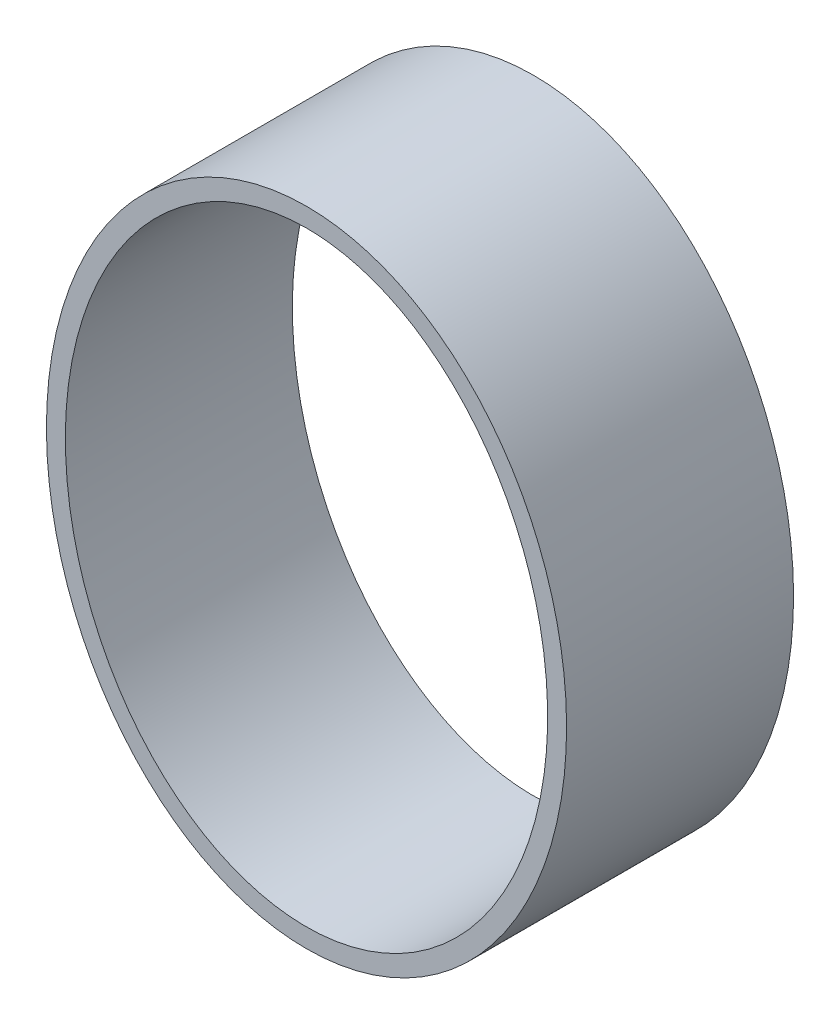
ISO-10303-21;
HEADER;
FILE_DESCRIPTION(('STEP AP214'),'2;1');
FILE_NAME('part.step','',(''),(''),'','','');
FILE_SCHEMA(('AUTOMOTIVE_DESIGN { 1 0 10303 214 1 1 1 1 }'));
ENDSEC;
DATA;
#1=APPLICATION_CONTEXT('core data for automotive mechanical design processes');
#2=APPLICATION_PROTOCOL_DEFINITION('international standard','automotive_design',2000,#1);
#3=PRODUCT_CONTEXT('',#1,'mechanical');
#4=PRODUCT('Part','Part','',(#3));
#5=PRODUCT_RELATED_PRODUCT_CATEGORY('part','',(#4));
#6=PRODUCT_DEFINITION_FORMATION('','',#4);
#7=PRODUCT_DEFINITION_CONTEXT('part definition',#1,'design');
#8=PRODUCT_DEFINITION('design','',#6,#7);
#9=PRODUCT_DEFINITION_SHAPE('','',#8);
#10=(LENGTH_UNIT() NAMED_UNIT(*) SI_UNIT(.MILLI.,.METRE.));
#11=(NAMED_UNIT(*) PLANE_ANGLE_UNIT() SI_UNIT($,.RADIAN.));
#12=(NAMED_UNIT(*) SI_UNIT($,.STERADIAN.) SOLID_ANGLE_UNIT());
#13=UNCERTAINTY_MEASURE_WITH_UNIT(LENGTH_MEASURE(1.E-05),#10,'distance_accuracy_value','');
#14=(GEOMETRIC_REPRESENTATION_CONTEXT(3) GLOBAL_UNCERTAINTY_ASSIGNED_CONTEXT((#13)) GLOBAL_UNIT_ASSIGNED_CONTEXT((#10,
#11,#12)) REPRESENTATION_CONTEXT('',''));
#15=CARTESIAN_POINT('',(0.,0.,0.));
#16=DIRECTION('',(0.,0.,1.));
#17=DIRECTION('',(1.,0.,0.));
#18=AXIS2_PLACEMENT_3D('',#15,#16,#17);
#19=CARTESIAN_POINT('',(0.,0.,24.));
#20=DIRECTION('',(0.,0.,1.));
#21=DIRECTION('',(1.,0.,0.));
#22=AXIS2_PLACEMENT_3D('',#19,#20,#21);
#23=PLANE('',#22);
#24=CARTESIAN_POINT('',(0.,0.,24.));
#25=DIRECTION('',(0.,0.,1.));
#26=DIRECTION('',(0.,1.,0.));
#27=AXIS2_PLACEMENT_3D('',#24,#25,#26);
#28=ELLIPSE('',#27,34.,27.5);
#29=CARTESIAN_POINT('',(0.,34.,24.));
#30=VERTEX_POINT('',#29);
#31=EDGE_CURVE('E10',#30,#30,#28,.T.);
#32=ORIENTED_EDGE('',*,*,#31,.T.);
#33=EDGE_LOOP('',(#32));
#34=FACE_BOUND('',#33,.T.);
#35=CARTESIAN_POINT('',(0.,32.,24.));
#36=CARTESIAN_POINT('',(-3.27739352305501,32.,24.));
#37=CARTESIAN_POINT('',(-9.83218056916502,30.3979492822931,24.));
#38=CARTESIAN_POINT('',(-18.34418121465,23.3977500989621,24.));
#39=CARTESIAN_POINT('',(-24.1335806037276,12.7144026907404,24.));
#40=CARTESIAN_POINT('',(-26.1832096981362,0.,24.));
#41=CARTESIAN_POINT('',(-24.1335806037276,-12.7144026907403,24.));
#42=CARTESIAN_POINT('',(-18.34418121465,-23.397750098962,24.));
#43=CARTESIAN_POINT('',(-9.83218056916502,-30.3979492822931,24.));
#44=CARTESIAN_POINT('',(0.,-32.8010253588534,24.));
#45=CARTESIAN_POINT('',(9.83218056916501,-30.3979492822931,24.));
#46=CARTESIAN_POINT('',(18.34418121465,-23.3977500989621,24.));
#47=CARTESIAN_POINT('',(24.1335806037276,-12.7144026907404,24.));
#48=CARTESIAN_POINT('',(26.1832096981362,0.,24.));
#49=CARTESIAN_POINT('',(24.1335806037276,12.7144026907404,24.));
#50=CARTESIAN_POINT('',(18.34418121465,23.397750098962,24.));
#51=CARTESIAN_POINT('',(9.83218056916503,30.3979492822931,24.));
#52=CARTESIAN_POINT('',(3.27739352305501,32.,24.));
#53=CARTESIAN_POINT('',(0.,32.,24.));
#54=B_SPLINE_CURVE_WITH_KNOTS('',3,(#35,#36,#37,#38,#39,#40,#41,#42,#43,#44,#45,#46,#47,#48,#49,
#50,#51,#52,#53),.UNSPECIFIED.,.T.,.F.,(4,1,1,1,1,1,1,1,1,1,1,1,1,1,1,1,4),(0.,
0.392699081698724,0.785398163397448,1.17809724509617,1.5707963267949,1.96349540849362,
2.35619449019234,2.74889357189107,3.14159265358979,3.53429173528852,3.92699081698724,
4.31968989868597,4.71238898038469,5.10508806208341,5.49778714378214,5.89048622548086,
6.28318530717959),.UNSPECIFIED.);
#55=CARTESIAN_POINT('',(0.,32.,24.));
#56=VERTEX_POINT('',#55);
#57=EDGE_CURVE('E48',#56,#56,#54,.T.);
#58=ORIENTED_EDGE('',*,*,#57,.F.);
#59=EDGE_LOOP('',(#58));
#60=FACE_BOUND('',#59,.T.);
#61=ADVANCED_FACE('F34',(#34,#60),#23,.T.);
#62=CARTESIAN_POINT('',(0.,0.,0.));
#63=DIRECTION('',(0.,0.,1.));
#64=DIRECTION('',(1.,0.,0.));
#65=AXIS2_PLACEMENT_3D('',#62,#63,#64);
#66=PLANE('',#65);
#67=CARTESIAN_POINT('',(0.,0.,0.));
#68=DIRECTION('',(0.,0.,1.));
#69=DIRECTION('',(0.,1.,0.));
#70=AXIS2_PLACEMENT_3D('',#67,#68,#69);
#71=ELLIPSE('',#70,34.,27.5);
#72=CARTESIAN_POINT('',(0.,34.,0.));
#73=VERTEX_POINT('',#72);
#74=EDGE_CURVE('E39',#73,#73,#71,.T.);
#75=ORIENTED_EDGE('',*,*,#74,.F.);
#76=EDGE_LOOP('',(#75));
#77=FACE_BOUND('',#76,.T.);
#78=CARTESIAN_POINT('',(0.,32.,0.));
#79=CARTESIAN_POINT('',(-3.27739352305501,32.,0.));
#80=CARTESIAN_POINT('',(-9.83218056916502,30.3979492822931,0.));
#81=CARTESIAN_POINT('',(-18.34418121465,23.3977500989621,0.));
#82=CARTESIAN_POINT('',(-24.1335806037276,12.7144026907404,0.));
#83=CARTESIAN_POINT('',(-26.1832096981362,0.,0.));
#84=CARTESIAN_POINT('',(-24.1335806037276,-12.7144026907403,0.));
#85=CARTESIAN_POINT('',(-18.34418121465,-23.397750098962,0.));
#86=CARTESIAN_POINT('',(-9.83218056916502,-30.3979492822931,0.));
#87=CARTESIAN_POINT('',(0.,-32.8010253588534,0.));
#88=CARTESIAN_POINT('',(9.83218056916501,-30.3979492822931,0.));
#89=CARTESIAN_POINT('',(18.34418121465,-23.3977500989621,0.));
#90=CARTESIAN_POINT('',(24.1335806037276,-12.7144026907404,0.));
#91=CARTESIAN_POINT('',(26.1832096981362,0.,0.));
#92=CARTESIAN_POINT('',(24.1335806037276,12.7144026907404,0.));
#93=CARTESIAN_POINT('',(18.34418121465,23.397750098962,0.));
#94=CARTESIAN_POINT('',(9.83218056916503,30.3979492822931,0.));
#95=CARTESIAN_POINT('',(3.27739352305501,32.,0.));
#96=CARTESIAN_POINT('',(0.,32.,0.));
#97=B_SPLINE_CURVE_WITH_KNOTS('',3,(#78,#79,#80,#81,#82,#83,#84,#85,#86,#87,#88,#89,#90,#91,#92,
#93,#94,#95,#96),.UNSPECIFIED.,.T.,.F.,(4,1,1,1,1,1,1,1,1,1,1,1,1,1,1,1,4),(0.,
0.392699081698724,0.785398163397448,1.17809724509617,1.5707963267949,1.96349540849362,
2.35619449019234,2.74889357189107,3.14159265358979,3.53429173528852,3.92699081698724,
4.31968989868597,4.71238898038469,5.10508806208341,5.49778714378214,5.89048622548086,
6.28318530717959),.UNSPECIFIED.);
#98=CARTESIAN_POINT('',(0.,32.,0.));
#99=VERTEX_POINT('',#98);
#100=EDGE_CURVE('E51',#99,#99,#97,.T.);
#101=ORIENTED_EDGE('',*,*,#100,.T.);
#102=EDGE_LOOP('',(#101));
#103=FACE_BOUND('',#102,.T.);
#104=ADVANCED_FACE('F73',(#77,#103),#66,.F.);
#105=DIRECTION('',(0.,0.,-1.));
#106=VECTOR('',#105,1.);
#107=SURFACE_OF_LINEAR_EXTRUSION('',#28,#106);
#108=ORIENTED_EDGE('',*,*,#31,.F.);
#109=EDGE_LOOP('',(#108));
#110=FACE_BOUND('',#109,.T.);
#111=ORIENTED_EDGE('',*,*,#74,.T.);
#112=EDGE_LOOP('',(#111));
#113=FACE_BOUND('',#112,.T.);
#114=ADVANCED_FACE('F36',(#110,#113),#107,.F.);
#115=DIRECTION('',(0.,0.,-1.));
#116=VECTOR('',#115,1.);
#117=SURFACE_OF_LINEAR_EXTRUSION('',#54,#116);
#118=ORIENTED_EDGE('',*,*,#57,.T.);
#119=EDGE_LOOP('',(#118));
#120=FACE_BOUND('',#119,.T.);
#121=ORIENTED_EDGE('',*,*,#100,.F.);
#122=EDGE_LOOP('',(#121));
#123=FACE_BOUND('',#122,.T.);
#124=ADVANCED_FACE('F68',(#120,#123),#117,.T.);
#125=CLOSED_SHELL('',(#61,#104,#114,#124));
#126=MANIFOLD_SOLID_BREP('B2',#125);
#127=ADVANCED_BREP_SHAPE_REPRESENTATION('',(#18,#126),#14);
#128=SHAPE_DEFINITION_REPRESENTATION(#9,#127);
ENDSEC;
END-ISO-10303-21;
